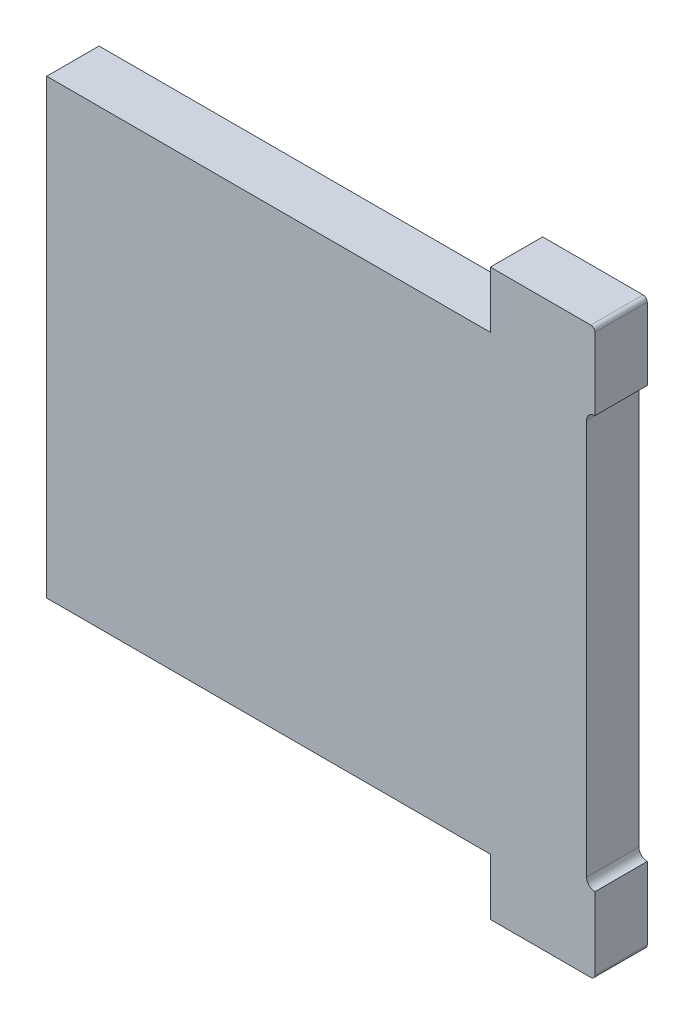
ISO-10303-21;
HEADER;
FILE_DESCRIPTION(('STEP AP214'),'2;1');
FILE_NAME('part.step','',(''),(''),'','','');
FILE_SCHEMA(('AUTOMOTIVE_DESIGN { 1 0 10303 214 1 1 1 1 }'));
ENDSEC;
DATA;
#1=APPLICATION_CONTEXT('core data for automotive mechanical design processes');
#2=APPLICATION_PROTOCOL_DEFINITION('international standard','automotive_design',2000,#1);
#3=PRODUCT_CONTEXT('',#1,'mechanical');
#4=PRODUCT('Part','Part','',(#3));
#5=PRODUCT_RELATED_PRODUCT_CATEGORY('part','',(#4));
#6=PRODUCT_DEFINITION_FORMATION('','',#4);
#7=PRODUCT_DEFINITION_CONTEXT('part definition',#1,'design');
#8=PRODUCT_DEFINITION('design','',#6,#7);
#9=PRODUCT_DEFINITION_SHAPE('','',#8);
#10=(LENGTH_UNIT() NAMED_UNIT(*) SI_UNIT(.MILLI.,.METRE.));
#11=(NAMED_UNIT(*) PLANE_ANGLE_UNIT() SI_UNIT($,.RADIAN.));
#12=(NAMED_UNIT(*) SI_UNIT($,.STERADIAN.) SOLID_ANGLE_UNIT());
#13=UNCERTAINTY_MEASURE_WITH_UNIT(LENGTH_MEASURE(1.E-05),#10,'distance_accuracy_value','');
#14=(GEOMETRIC_REPRESENTATION_CONTEXT(3) GLOBAL_UNCERTAINTY_ASSIGNED_CONTEXT((#13)) GLOBAL_UNIT_ASSIGNED_CONTEXT((#10,
#11,#12)) REPRESENTATION_CONTEXT('',''));
#15=CARTESIAN_POINT('',(0.,0.,0.));
#16=DIRECTION('',(0.,0.,1.));
#17=DIRECTION('',(1.,0.,0.));
#18=AXIS2_PLACEMENT_3D('',#15,#16,#17);
#19=CARTESIAN_POINT('',(202.556744279938,98.8320432923502,112.211582908599));
#20=DIRECTION('',(-1.,0.,0.));
#21=DIRECTION('',(0.,0.,1.));
#22=AXIS2_PLACEMENT_3D('',#19,#20,#21);
#23=PLANE('',#22);
#24=DIRECTION('',(0.,0.,1.));
#25=VECTOR('',#24,1.);
#26=CARTESIAN_POINT('',(202.556744279938,98.8320432923502,112.211582908599));
#27=LINE('',#26,#25);
#28=CARTESIAN_POINT('',(202.556744279938,98.8320432923502,112.211582908599));
#29=VERTEX_POINT('',#28);
#30=CARTESIAN_POINT('',(202.556744279938,98.8320432923502,112.711582908599));
#31=VERTEX_POINT('',#30);
#32=EDGE_CURVE('E11',#29,#31,#27,.T.);
#33=ORIENTED_EDGE('',*,*,#32,.T.);
#34=DIRECTION('',(0.,1.,0.));
#35=VECTOR('',#34,1.);
#36=CARTESIAN_POINT('',(202.556744279938,98.8320432923502,112.711582908599));
#37=LINE('',#36,#35);
#38=CARTESIAN_POINT('',(202.556744279938,99.3720432923502,112.711582908599));
#39=VERTEX_POINT('',#38);
#40=EDGE_CURVE('E54',#31,#39,#37,.T.);
#41=ORIENTED_EDGE('',*,*,#40,.T.);
#42=DIRECTION('',(0.,0.,1.));
#43=VECTOR('',#42,1.);
#44=CARTESIAN_POINT('',(202.556744279938,99.3720432923502,112.211582908599));
#45=LINE('',#44,#43);
#46=CARTESIAN_POINT('',(202.556744279938,99.3720432923502,112.211582908599));
#47=VERTEX_POINT('',#46);
#48=EDGE_CURVE('E266',#47,#39,#45,.T.);
#49=ORIENTED_EDGE('',*,*,#48,.F.);
#50=DIRECTION('',(0.,1.,0.));
#51=VECTOR('',#50,1.);
#52=CARTESIAN_POINT('',(202.556744279938,98.8320432923502,112.211582908599));
#53=LINE('',#52,#51);
#54=EDGE_CURVE('E231',#29,#47,#53,.T.);
#55=ORIENTED_EDGE('',*,*,#54,.F.);
#56=EDGE_LOOP('',(#33,#41,#49,#55));
#57=FACE_BOUND('',#56,.T.);
#58=ADVANCED_FACE('F44',(#57),#23,.T.);
#59=CARTESIAN_POINT('',(202.556744279938,99.3720432923502,112.211582908599));
#60=DIRECTION('',(0.,-1.,0.));
#61=DIRECTION('',(0.,0.,-1.));
#62=AXIS2_PLACEMENT_3D('',#59,#60,#61);
#63=PLANE('',#62);
#64=ORIENTED_EDGE('',*,*,#48,.T.);
#65=DIRECTION('',(-1.,0.,0.));
#66=VECTOR('',#65,1.);
#67=CARTESIAN_POINT('',(202.556744279938,99.3720432923502,112.711582908599));
#68=LINE('',#67,#66);
#69=CARTESIAN_POINT('',(198.316744279938,99.3720432923502,112.711582908599));
#70=VERTEX_POINT('',#69);
#71=EDGE_CURVE('E318',#39,#70,#68,.T.);
#72=ORIENTED_EDGE('',*,*,#71,.T.);
#73=DIRECTION('',(0.,0.,1.));
#74=VECTOR('',#73,1.);
#75=CARTESIAN_POINT('',(198.316744279938,99.3720432923502,112.211582908599));
#76=LINE('',#75,#74);
#77=CARTESIAN_POINT('',(198.316744279938,99.3720432923502,112.211582908599));
#78=VERTEX_POINT('',#77);
#79=EDGE_CURVE('E315',#78,#70,#76,.T.);
#80=ORIENTED_EDGE('',*,*,#79,.F.);
#81=DIRECTION('',(-1.,0.,0.));
#82=VECTOR('',#81,1.);
#83=CARTESIAN_POINT('',(202.556744279938,99.3720432923502,112.211582908599));
#84=LINE('',#83,#82);
#85=EDGE_CURVE('E244',#47,#78,#84,.T.);
#86=ORIENTED_EDGE('',*,*,#85,.F.);
#87=EDGE_LOOP('',(#64,#72,#80,#86));
#88=FACE_BOUND('',#87,.T.);
#89=ADVANCED_FACE('F339',(#88),#63,.T.);
#90=CARTESIAN_POINT('',(198.316744279938,99.3720432923502,112.211582908599));
#91=DIRECTION('',(-1.,0.,0.));
#92=DIRECTION('',(0.,0.,1.));
#93=AXIS2_PLACEMENT_3D('',#90,#91,#92);
#94=PLANE('',#93);
#95=ORIENTED_EDGE('',*,*,#79,.T.);
#96=DIRECTION('',(0.,1.,0.));
#97=VECTOR('',#96,1.);
#98=CARTESIAN_POINT('',(198.316744279938,99.3720432923502,112.711582908599));
#99=LINE('',#98,#97);
#100=CARTESIAN_POINT('',(198.316744279938,103.69204329235,112.711582908599));
#101=VERTEX_POINT('',#100);
#102=EDGE_CURVE('E277',#70,#101,#99,.T.);
#103=ORIENTED_EDGE('',*,*,#102,.T.);
#104=DIRECTION('',(0.,0.,1.));
#105=VECTOR('',#104,1.);
#106=CARTESIAN_POINT('',(198.316744279938,103.69204329235,112.211582908599));
#107=LINE('',#106,#105);
#108=CARTESIAN_POINT('',(198.316744279938,103.69204329235,112.211582908599));
#109=VERTEX_POINT('',#108);
#110=EDGE_CURVE('E274',#109,#101,#107,.T.);
#111=ORIENTED_EDGE('',*,*,#110,.F.);
#112=DIRECTION('',(0.,1.,0.));
#113=VECTOR('',#112,1.);
#114=CARTESIAN_POINT('',(198.316744279938,99.3720432923502,112.211582908599));
#115=LINE('',#114,#113);
#116=EDGE_CURVE('E246',#78,#109,#115,.T.);
#117=ORIENTED_EDGE('',*,*,#116,.F.);
#118=EDGE_LOOP('',(#95,#103,#111,#117));
#119=FACE_BOUND('',#118,.T.);
#120=ADVANCED_FACE('F356',(#119),#94,.T.);
#121=CARTESIAN_POINT('',(198.316744279938,103.69204329235,112.211582908599));
#122=DIRECTION('',(0.,1.,0.));
#123=DIRECTION('',(1.,0.,0.));
#124=AXIS2_PLACEMENT_3D('',#121,#122,#123);
#125=PLANE('',#124);
#126=ORIENTED_EDGE('',*,*,#110,.T.);
#127=DIRECTION('',(1.,0.,0.));
#128=VECTOR('',#127,1.);
#129=CARTESIAN_POINT('',(198.316744279938,103.69204329235,112.711582908599));
#130=LINE('',#129,#128);
#131=CARTESIAN_POINT('',(202.556744279938,103.69204329235,112.711582908599));
#132=VERTEX_POINT('',#131);
#133=EDGE_CURVE('E47',#101,#132,#130,.T.);
#134=ORIENTED_EDGE('',*,*,#133,.T.);
#135=DIRECTION('',(0.,0.,1.));
#136=VECTOR('',#135,1.);
#137=CARTESIAN_POINT('',(202.556744279938,103.69204329235,112.211582908599));
#138=LINE('',#137,#136);
#139=CARTESIAN_POINT('',(202.556744279938,103.69204329235,112.211582908599));
#140=VERTEX_POINT('',#139);
#141=EDGE_CURVE('E220',#140,#132,#138,.T.);
#142=ORIENTED_EDGE('',*,*,#141,.F.);
#143=DIRECTION('',(1.,0.,0.));
#144=VECTOR('',#143,1.);
#145=CARTESIAN_POINT('',(198.316744279938,103.69204329235,112.211582908599));
#146=LINE('',#145,#144);
#147=EDGE_CURVE('E254',#109,#140,#146,.T.);
#148=ORIENTED_EDGE('',*,*,#147,.F.);
#149=EDGE_LOOP('',(#126,#134,#142,#148));
#150=FACE_BOUND('',#149,.T.);
#151=ADVANCED_FACE('F361',(#150),#125,.T.);
#152=CARTESIAN_POINT('',(202.556744279938,103.69204329235,112.211582908599));
#153=DIRECTION('',(-1.,0.,0.));
#154=DIRECTION('',(0.,0.,1.));
#155=AXIS2_PLACEMENT_3D('',#152,#153,#154);
#156=PLANE('',#155);
#157=ORIENTED_EDGE('',*,*,#141,.T.);
#158=DIRECTION('',(0.,1.,0.));
#159=VECTOR('',#158,1.);
#160=CARTESIAN_POINT('',(202.556744279938,103.69204329235,112.711582908599));
#161=LINE('',#160,#159);
#162=CARTESIAN_POINT('',(202.556744279938,104.23204329235,112.711582908599));
#163=VERTEX_POINT('',#162);
#164=EDGE_CURVE('E217',#132,#163,#161,.T.);
#165=ORIENTED_EDGE('',*,*,#164,.T.);
#166=DIRECTION('',(0.,0.,1.));
#167=VECTOR('',#166,1.);
#168=CARTESIAN_POINT('',(202.556744279938,104.23204329235,112.211582908599));
#169=LINE('',#168,#167);
#170=CARTESIAN_POINT('',(202.556744279938,104.23204329235,112.211582908599));
#171=VERTEX_POINT('',#170);
#172=EDGE_CURVE('E221',#171,#163,#169,.T.);
#173=ORIENTED_EDGE('',*,*,#172,.F.);
#174=DIRECTION('',(0.,1.,0.));
#175=VECTOR('',#174,1.);
#176=CARTESIAN_POINT('',(202.556744279938,103.69204329235,112.211582908599));
#177=LINE('',#176,#175);
#178=EDGE_CURVE('E262',#140,#171,#177,.T.);
#179=ORIENTED_EDGE('',*,*,#178,.F.);
#180=EDGE_LOOP('',(#157,#165,#173,#179));
#181=FACE_BOUND('',#180,.T.);
#182=ADVANCED_FACE('F384',(#181),#156,.T.);
#183=CARTESIAN_POINT('',(202.556744279938,104.23204329235,112.211582908599));
#184=DIRECTION('',(0.,1.,0.));
#185=DIRECTION('',(1.,0.,0.));
#186=AXIS2_PLACEMENT_3D('',#183,#184,#185);
#187=PLANE('',#186);
#188=DIRECTION('',(1.,0.,0.));
#189=VECTOR('',#188,1.);
#190=CARTESIAN_POINT('',(202.556744279938,104.23204329235,112.211582908599));
#191=LINE('',#190,#189);
#192=CARTESIAN_POINT('',(203.516744279938,104.23204329235,112.211582908599));
#193=VERTEX_POINT('',#192);
#194=EDGE_CURVE('E269',#171,#193,#191,.T.);
#195=ORIENTED_EDGE('',*,*,#194,.F.);
#196=ORIENTED_EDGE('',*,*,#172,.T.);
#197=DIRECTION('',(1.,0.,0.));
#198=VECTOR('',#197,1.);
#199=CARTESIAN_POINT('',(202.556744279938,104.23204329235,112.711582908599));
#200=LINE('',#199,#198);
#201=CARTESIAN_POINT('',(203.516744279938,104.23204329235,112.711582908599));
#202=VERTEX_POINT('',#201);
#203=EDGE_CURVE('E295',#163,#202,#200,.T.);
#204=ORIENTED_EDGE('',*,*,#203,.T.);
#205=DIRECTION('',(0.,0.,1.));
#206=VECTOR('',#205,1.);
#207=CARTESIAN_POINT('',(203.516744279938,104.23204329235,112.211582908599));
#208=LINE('',#207,#206);
#209=EDGE_CURVE('E235',#193,#202,#208,.T.);
#210=ORIENTED_EDGE('',*,*,#209,.F.);
#211=EDGE_LOOP('',(#195,#196,#204,#210));
#212=FACE_BOUND('',#211,.T.);
#213=ADVANCED_FACE('F370',(#212),#187,.T.);
#214=CARTESIAN_POINT('',(203.516744279938,104.19204329235,112.211582908599));
#215=DIRECTION('',(0.,0.,1.));
#216=DIRECTION('',(1.,0.,0.));
#217=AXIS2_PLACEMENT_3D('',#214,#215,#216);
#218=CYLINDRICAL_SURFACE('',#217,0.0400000000000123);
#219=CARTESIAN_POINT('',(203.516744279938,104.19204329235,112.211582908599));
#220=DIRECTION('',(0.,0.,1.));
#221=DIRECTION('',(0.,-1.,0.));
#222=AXIS2_PLACEMENT_3D('',#219,#220,#221);
#223=CIRCLE('',#222,0.0399999999999983);
#224=CARTESIAN_POINT('',(203.556744279938,104.19204329235,112.211582908599));
#225=VERTEX_POINT('',#224);
#226=EDGE_CURVE('E215',#225,#193,#223,.T.);
#227=ORIENTED_EDGE('',*,*,#226,.T.);
#228=ORIENTED_EDGE('',*,*,#209,.T.);
#229=CARTESIAN_POINT('',(203.516744279938,104.19204329235,112.711582908599));
#230=DIRECTION('',(0.,0.,1.));
#231=DIRECTION('',(0.,-1.,0.));
#232=AXIS2_PLACEMENT_3D('',#229,#230,#231);
#233=CIRCLE('',#232,0.0399999999999983);
#234=CARTESIAN_POINT('',(203.556744279938,104.19204329235,112.711582908599));
#235=VERTEX_POINT('',#234);
#236=EDGE_CURVE('E322',#235,#202,#233,.T.);
#237=ORIENTED_EDGE('',*,*,#236,.F.);
#238=DIRECTION('',(0.,0.,1.));
#239=VECTOR('',#238,1.);
#240=CARTESIAN_POINT('',(203.556744279938,104.19204329235,112.211582908599));
#241=LINE('',#240,#239);
#242=EDGE_CURVE('E222',#225,#235,#241,.T.);
#243=ORIENTED_EDGE('',*,*,#242,.F.);
#244=EDGE_LOOP('',(#227,#228,#237,#243));
#245=FACE_BOUND('',#244,.T.);
#246=ADVANCED_FACE('F366',(#245),#218,.T.);
#247=CARTESIAN_POINT('',(203.556744279938,101.53204329235,112.211582908599));
#248=DIRECTION('',(1.,0.,0.));
#249=DIRECTION('',(0.,1.,0.));
#250=AXIS2_PLACEMENT_3D('',#247,#248,#249);
#251=PLANE('',#250);
#252=DIRECTION('',(0.,0.,-1.));
#253=VECTOR('',#252,1.);
#254=CARTESIAN_POINT('',(203.556744279938,103.50204329235,112.211582908599));
#255=LINE('',#254,#253);
#256=CARTESIAN_POINT('',(203.556744279938,103.50204329235,112.711582908599));
#257=VERTEX_POINT('',#256);
#258=CARTESIAN_POINT('',(203.556744279938,103.50204329235,112.211582908599));
#259=VERTEX_POINT('',#258);
#260=EDGE_CURVE('E238',#257,#259,#255,.T.);
#261=ORIENTED_EDGE('',*,*,#260,.T.);
#262=DIRECTION('',(0.,1.,0.));
#263=VECTOR('',#262,1.);
#264=CARTESIAN_POINT('',(203.556744279938,98.8320432923502,112.211582908599));
#265=LINE('',#264,#263);
#266=EDGE_CURVE('E225',#259,#225,#265,.T.);
#267=ORIENTED_EDGE('',*,*,#266,.T.);
#268=ORIENTED_EDGE('',*,*,#242,.T.);
#269=DIRECTION('',(0.,-1.,0.));
#270=VECTOR('',#269,1.);
#271=CARTESIAN_POINT('',(203.556744279938,104.23204329235,112.711582908599));
#272=LINE('',#271,#270);
#273=EDGE_CURVE('E226',#235,#257,#272,.T.);
#274=ORIENTED_EDGE('',*,*,#273,.T.);
#275=EDGE_LOOP('',(#261,#267,#268,#274));
#276=FACE_BOUND('',#275,.T.);
#277=ADVANCED_FACE('F369',(#276),#251,.T.);
#278=CARTESIAN_POINT('',(203.556744279938,103.42204329235,112.211582908599));
#279=DIRECTION('',(0.,0.,-1.));
#280=DIRECTION('',(1.,0.,0.));
#281=AXIS2_PLACEMENT_3D('',#278,#279,#280);
#282=CYLINDRICAL_SURFACE('',#281,0.0799999999999967);
#283=CARTESIAN_POINT('',(203.556744279938,103.42204329235,112.211582908599));
#284=DIRECTION('',(0.,0.,1.));
#285=DIRECTION('',(1.,0.,0.));
#286=AXIS2_PLACEMENT_3D('',#283,#284,#285);
#287=CIRCLE('',#286,0.0799999999999967);
#288=CARTESIAN_POINT('',(203.476744279938,103.42204329235,112.211582908599));
#289=VERTEX_POINT('',#288);
#290=EDGE_CURVE('E200',#259,#289,#287,.T.);
#291=ORIENTED_EDGE('',*,*,#290,.F.);
#292=ORIENTED_EDGE('',*,*,#260,.F.);
#293=CARTESIAN_POINT('',(203.556744279938,103.42204329235,112.711582908599));
#294=DIRECTION('',(0.,0.,-1.));
#295=DIRECTION('',(1.,0.,0.));
#296=AXIS2_PLACEMENT_3D('',#293,#294,#295);
#297=CIRCLE('',#296,0.0799999999999967);
#298=CARTESIAN_POINT('',(203.476744279938,103.42204329235,112.711582908599));
#299=VERTEX_POINT('',#298);
#300=EDGE_CURVE('E243',#299,#257,#297,.T.);
#301=ORIENTED_EDGE('',*,*,#300,.F.);
#302=DIRECTION('',(0.,0.,1.));
#303=VECTOR('',#302,1.);
#304=CARTESIAN_POINT('',(203.476744279938,103.42204329235,112.211582908599));
#305=LINE('',#304,#303);
#306=EDGE_CURVE('E234',#289,#299,#305,.T.);
#307=ORIENTED_EDGE('',*,*,#306,.F.);
#308=EDGE_LOOP('',(#291,#292,#301,#307));
#309=FACE_BOUND('',#308,.T.);
#310=ADVANCED_FACE('F349',(#309),#282,.F.);
#311=CARTESIAN_POINT('',(203.476744279938,103.42204329235,112.211582908599));
#312=DIRECTION('',(1.,0.,0.));
#313=DIRECTION('',(0.,1.,0.));
#314=AXIS2_PLACEMENT_3D('',#311,#312,#313);
#315=PLANE('',#314);
#316=ORIENTED_EDGE('',*,*,#306,.T.);
#317=DIRECTION('',(0.,-1.,0.));
#318=VECTOR('',#317,1.);
#319=CARTESIAN_POINT('',(203.476744279938,103.42204329235,112.711582908599));
#320=LINE('',#319,#318);
#321=CARTESIAN_POINT('',(203.476744279938,99.6420432923502,112.711582908599));
#322=VERTEX_POINT('',#321);
#323=EDGE_CURVE('E186',#299,#322,#320,.T.);
#324=ORIENTED_EDGE('',*,*,#323,.T.);
#325=DIRECTION('',(0.,0.,1.));
#326=VECTOR('',#325,1.);
#327=CARTESIAN_POINT('',(203.476744279938,99.6420432923502,112.211582908599));
#328=LINE('',#327,#326);
#329=CARTESIAN_POINT('',(203.476744279938,99.6420432923502,112.211582908599));
#330=VERTEX_POINT('',#329);
#331=EDGE_CURVE('E180',#330,#322,#328,.T.);
#332=ORIENTED_EDGE('',*,*,#331,.F.);
#333=DIRECTION('',(0.,-1.,0.));
#334=VECTOR('',#333,1.);
#335=CARTESIAN_POINT('',(203.476744279938,103.42204329235,112.211582908599));
#336=LINE('',#335,#334);
#337=EDGE_CURVE('E184',#289,#330,#336,.T.);
#338=ORIENTED_EDGE('',*,*,#337,.F.);
#339=EDGE_LOOP('',(#316,#324,#332,#338));
#340=FACE_BOUND('',#339,.T.);
#341=ADVANCED_FACE('F183',(#340),#315,.T.);
#342=CARTESIAN_POINT('',(203.556744279938,98.8320432923502,112.211582908599));
#343=DIRECTION('',(0.,-1.,0.));
#344=DIRECTION('',(0.,0.,-1.));
#345=AXIS2_PLACEMENT_3D('',#342,#343,#344);
#346=PLANE('',#345);
#347=DIRECTION('',(-1.,0.,0.));
#348=VECTOR('',#347,1.);
#349=CARTESIAN_POINT('',(203.556744279938,98.8320432923502,112.211582908599));
#350=LINE('',#349,#348);
#351=CARTESIAN_POINT('',(203.516744279938,98.8320432923502,112.211582908599));
#352=VERTEX_POINT('',#351);
#353=EDGE_CURVE('E173',#352,#29,#350,.T.);
#354=ORIENTED_EDGE('',*,*,#353,.F.);
#355=DIRECTION('',(0.,0.,1.));
#356=VECTOR('',#355,1.);
#357=CARTESIAN_POINT('',(203.516744279938,98.8320432923502,112.211582908599));
#358=LINE('',#357,#356);
#359=CARTESIAN_POINT('',(203.516744279938,98.8320432923502,112.711582908599));
#360=VERTEX_POINT('',#359);
#361=EDGE_CURVE('E240',#352,#360,#358,.T.);
#362=ORIENTED_EDGE('',*,*,#361,.T.);
#363=DIRECTION('',(-1.,0.,0.));
#364=VECTOR('',#363,1.);
#365=CARTESIAN_POINT('',(203.556744279938,98.8320432923502,112.711582908599));
#366=LINE('',#365,#364);
#367=EDGE_CURVE('E280',#360,#31,#366,.T.);
#368=ORIENTED_EDGE('',*,*,#367,.T.);
#369=ORIENTED_EDGE('',*,*,#32,.F.);
#370=EDGE_LOOP('',(#354,#362,#368,#369));
#371=FACE_BOUND('',#370,.T.);
#372=ADVANCED_FACE('F341',(#371),#346,.T.);
#373=CARTESIAN_POINT('',(201.151932249863,101.53204329235,112.211582908599));
#374=DIRECTION('',(0.,0.,-1.));
#375=DIRECTION('',(0.,-1.,0.));
#376=AXIS2_PLACEMENT_3D('',#373,#374,#375);
#377=PLANE('',#376);
#378=DIRECTION('',(0.,1.,0.));
#379=VECTOR('',#378,1.);
#380=CARTESIAN_POINT('',(203.556744279938,98.8320432923502,112.211582908599));
#381=LINE('',#380,#379);
#382=CARTESIAN_POINT('',(203.556744279938,98.8720432923502,112.211582908599));
#383=VERTEX_POINT('',#382);
#384=CARTESIAN_POINT('',(203.556744279938,99.5620432923502,112.211582908599));
#385=VERTEX_POINT('',#384);
#386=EDGE_CURVE('E281',#383,#385,#381,.T.);
#387=ORIENTED_EDGE('',*,*,#386,.F.);
#388=CARTESIAN_POINT('',(203.516744279938,98.8720432923502,112.211582908599));
#389=DIRECTION('',(0.,0.,-1.));
#390=DIRECTION('',(0.,-1.,0.));
#391=AXIS2_PLACEMENT_3D('',#388,#389,#390);
#392=CIRCLE('',#391,0.0399999999999983);
#393=EDGE_CURVE('E230',#383,#352,#392,.T.);
#394=ORIENTED_EDGE('',*,*,#393,.T.);
#395=ORIENTED_EDGE('',*,*,#353,.T.);
#396=ORIENTED_EDGE('',*,*,#54,.T.);
#397=ORIENTED_EDGE('',*,*,#85,.T.);
#398=ORIENTED_EDGE('',*,*,#116,.T.);
#399=ORIENTED_EDGE('',*,*,#147,.T.);
#400=ORIENTED_EDGE('',*,*,#178,.T.);
#401=ORIENTED_EDGE('',*,*,#194,.T.);
#402=ORIENTED_EDGE('',*,*,#226,.F.);
#403=ORIENTED_EDGE('',*,*,#266,.F.);
#404=ORIENTED_EDGE('',*,*,#290,.T.);
#405=ORIENTED_EDGE('',*,*,#337,.T.);
#406=CARTESIAN_POINT('',(203.556744279938,99.6420432923502,112.211582908599));
#407=DIRECTION('',(0.,0.,1.));
#408=DIRECTION('',(1.,0.,0.));
#409=AXIS2_PLACEMENT_3D('',#406,#407,#408);
#410=CIRCLE('',#409,0.0799999999999967);
#411=EDGE_CURVE('E197',#330,#385,#410,.T.);
#412=ORIENTED_EDGE('',*,*,#411,.T.);
#413=EDGE_LOOP('',(#387,#394,#395,#396,#397,#398,#399,#400,#401,#402,#403,#404,#405,#412));
#414=FACE_BOUND('',#413,.T.);
#415=ADVANCED_FACE('F196',(#414),#377,.T.);
#416=CARTESIAN_POINT('',(203.556744279938,99.6420432923502,112.211582908599));
#417=DIRECTION('',(0.,0.,-1.));
#418=DIRECTION('',(1.,0.,0.));
#419=AXIS2_PLACEMENT_3D('',#416,#417,#418);
#420=CYLINDRICAL_SURFACE('',#419,0.0799999999999967);
#421=DIRECTION('',(0.,0.,-1.));
#422=VECTOR('',#421,1.);
#423=CARTESIAN_POINT('',(203.556744279938,99.5620432923502,112.211582908599));
#424=LINE('',#423,#422);
#425=CARTESIAN_POINT('',(203.556744279938,99.5620432923502,112.711582908599));
#426=VERTEX_POINT('',#425);
#427=EDGE_CURVE('E191',#426,#385,#424,.T.);
#428=ORIENTED_EDGE('',*,*,#427,.T.);
#429=ORIENTED_EDGE('',*,*,#411,.F.);
#430=ORIENTED_EDGE('',*,*,#331,.T.);
#431=CARTESIAN_POINT('',(203.556744279938,99.6420432923502,112.711582908599));
#432=DIRECTION('',(0.,0.,-1.));
#433=DIRECTION('',(1.,0.,0.));
#434=AXIS2_PLACEMENT_3D('',#431,#432,#433);
#435=CIRCLE('',#434,0.0799999999999967);
#436=EDGE_CURVE('E192',#426,#322,#435,.T.);
#437=ORIENTED_EDGE('',*,*,#436,.F.);
#438=EDGE_LOOP('',(#428,#429,#430,#437));
#439=FACE_BOUND('',#438,.T.);
#440=ADVANCED_FACE('F204',(#439),#420,.F.);
#441=CARTESIAN_POINT('',(201.151932249863,101.53204329235,112.711582908599));
#442=DIRECTION('',(0.,0.,-1.));
#443=DIRECTION('',(0.,-1.,0.));
#444=AXIS2_PLACEMENT_3D('',#441,#442,#443);
#445=PLANE('',#444);
#446=DIRECTION('',(0.,-1.,0.));
#447=VECTOR('',#446,1.);
#448=CARTESIAN_POINT('',(203.556744279938,104.23204329235,112.711582908599));
#449=LINE('',#448,#447);
#450=CARTESIAN_POINT('',(203.556744279938,98.8720432923502,112.711582908599));
#451=VERTEX_POINT('',#450);
#452=EDGE_CURVE('E285',#426,#451,#449,.T.);
#453=ORIENTED_EDGE('',*,*,#452,.F.);
#454=ORIENTED_EDGE('',*,*,#436,.T.);
#455=ORIENTED_EDGE('',*,*,#323,.F.);
#456=ORIENTED_EDGE('',*,*,#300,.T.);
#457=ORIENTED_EDGE('',*,*,#273,.F.);
#458=ORIENTED_EDGE('',*,*,#236,.T.);
#459=ORIENTED_EDGE('',*,*,#203,.F.);
#460=ORIENTED_EDGE('',*,*,#164,.F.);
#461=ORIENTED_EDGE('',*,*,#133,.F.);
#462=ORIENTED_EDGE('',*,*,#102,.F.);
#463=ORIENTED_EDGE('',*,*,#71,.F.);
#464=ORIENTED_EDGE('',*,*,#40,.F.);
#465=ORIENTED_EDGE('',*,*,#367,.F.);
#466=CARTESIAN_POINT('',(203.516744279938,98.8720432923502,112.711582908599));
#467=DIRECTION('',(0.,0.,-1.));
#468=DIRECTION('',(0.,-1.,0.));
#469=AXIS2_PLACEMENT_3D('',#466,#467,#468);
#470=CIRCLE('',#469,0.0399999999999983);
#471=EDGE_CURVE('E284',#451,#360,#470,.T.);
#472=ORIENTED_EDGE('',*,*,#471,.F.);
#473=EDGE_LOOP('',(#453,#454,#455,#456,#457,#458,#459,#460,#461,#462,#463,#464,#465,#472));
#474=FACE_BOUND('',#473,.T.);
#475=ADVANCED_FACE('F404',(#474),#445,.F.);
#476=CARTESIAN_POINT('',(203.516744279938,98.8720432923502,112.211582908599));
#477=DIRECTION('',(0.,0.,1.));
#478=DIRECTION('',(1.,0.,0.));
#479=AXIS2_PLACEMENT_3D('',#476,#477,#478);
#480=CYLINDRICAL_SURFACE('',#479,0.0400000000000123);
#481=DIRECTION('',(0.,0.,1.));
#482=VECTOR('',#481,1.);
#483=CARTESIAN_POINT('',(203.556744279938,98.8720432923502,112.211582908599));
#484=LINE('',#483,#482);
#485=EDGE_CURVE('E293',#383,#451,#484,.T.);
#486=ORIENTED_EDGE('',*,*,#485,.T.);
#487=ORIENTED_EDGE('',*,*,#471,.T.);
#488=ORIENTED_EDGE('',*,*,#361,.F.);
#489=ORIENTED_EDGE('',*,*,#393,.F.);
#490=EDGE_LOOP('',(#486,#487,#488,#489));
#491=FACE_BOUND('',#490,.T.);
#492=ADVANCED_FACE('F381',(#491),#480,.T.);
#493=CARTESIAN_POINT('',(203.556744279938,101.53204329235,112.211582908599));
#494=DIRECTION('',(1.,0.,0.));
#495=DIRECTION('',(0.,1.,0.));
#496=AXIS2_PLACEMENT_3D('',#493,#494,#495);
#497=PLANE('',#496);
#498=ORIENTED_EDGE('',*,*,#485,.F.);
#499=ORIENTED_EDGE('',*,*,#386,.T.);
#500=ORIENTED_EDGE('',*,*,#427,.F.);
#501=ORIENTED_EDGE('',*,*,#452,.T.);
#502=EDGE_LOOP('',(#498,#499,#500,#501));
#503=FACE_BOUND('',#502,.T.);
#504=ADVANCED_FACE('F378',(#503),#497,.T.);
#505=CLOSED_SHELL('',(#58,#89,#120,#151,#182,#213,#246,#277,#310,#341,#372,#415,#440,#475,#492,#504));
#506=MANIFOLD_SOLID_BREP('B2',#505);
#507=ADVANCED_BREP_SHAPE_REPRESENTATION('',(#18,#506),#14);
#508=SHAPE_DEFINITION_REPRESENTATION(#9,#507);
ENDSEC;
END-ISO-10303-21;
